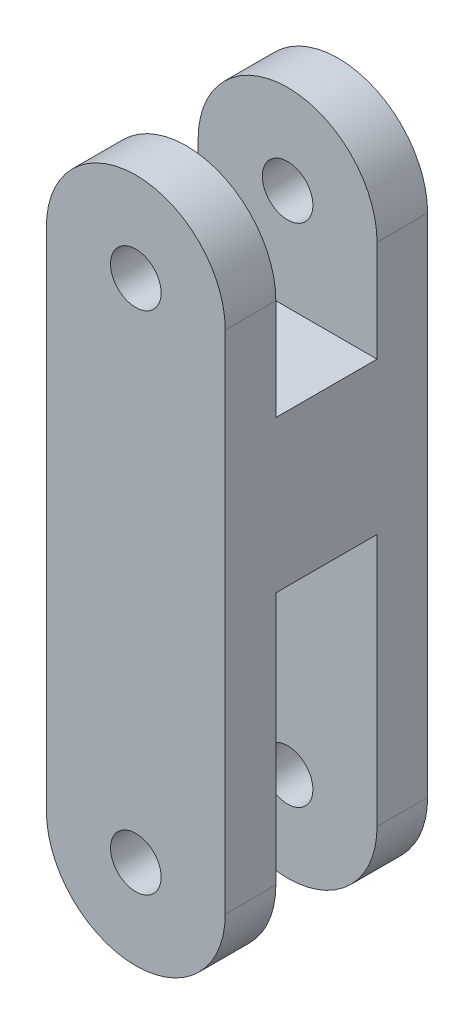
ISO-10303-21;
HEADER;
FILE_DESCRIPTION(('STEP AP214'),'2;1');
FILE_NAME('part.step','',(''),(''),'','','');
FILE_SCHEMA(('AUTOMOTIVE_DESIGN { 1 0 10303 214 1 1 1 1 }'));
ENDSEC;
DATA;
#1=APPLICATION_CONTEXT('core data for automotive mechanical design processes');
#2=APPLICATION_PROTOCOL_DEFINITION('international standard','automotive_design',2000,#1);
#3=PRODUCT_CONTEXT('',#1,'mechanical');
#4=PRODUCT('Part','Part','',(#3));
#5=PRODUCT_RELATED_PRODUCT_CATEGORY('part','',(#4));
#6=PRODUCT_DEFINITION_FORMATION('','',#4);
#7=PRODUCT_DEFINITION_CONTEXT('part definition',#1,'design');
#8=PRODUCT_DEFINITION('design','',#6,#7);
#9=PRODUCT_DEFINITION_SHAPE('','',#8);
#10=(LENGTH_UNIT() NAMED_UNIT(*) SI_UNIT(.MILLI.,.METRE.));
#11=(NAMED_UNIT(*) PLANE_ANGLE_UNIT() SI_UNIT($,.RADIAN.));
#12=(NAMED_UNIT(*) SI_UNIT($,.STERADIAN.) SOLID_ANGLE_UNIT());
#13=UNCERTAINTY_MEASURE_WITH_UNIT(LENGTH_MEASURE(1.E-05),#10,'distance_accuracy_value','');
#14=(GEOMETRIC_REPRESENTATION_CONTEXT(3) GLOBAL_UNCERTAINTY_ASSIGNED_CONTEXT((#13)) GLOBAL_UNIT_ASSIGNED_CONTEXT((#10,
#11,#12)) REPRESENTATION_CONTEXT('',''));
#15=CARTESIAN_POINT('',(0.,0.,0.));
#16=DIRECTION('',(0.,0.,1.));
#17=DIRECTION('',(1.,0.,0.));
#18=AXIS2_PLACEMENT_3D('',#15,#16,#17);
#19=CARTESIAN_POINT('',(35.3553390593274,-270.,-40.));
#20=DIRECTION('',(1.,0.,0.));
#21=DIRECTION('',(0.,1.,0.));
#22=AXIS2_PLACEMENT_3D('',#19,#20,#21);
#23=PLANE('',#22);
#24=DIRECTION('',(0.,0.,1.));
#25=VECTOR('',#24,1.);
#26=CARTESIAN_POINT('',(35.3553390593274,-170.,-112.736184954957));
#27=LINE('',#26,#25);
#28=CARTESIAN_POINT('',(35.3553390593274,-170.,-20.));
#29=VERTEX_POINT('',#28);
#30=CARTESIAN_POINT('',(35.3553390593274,-170.,20.));
#31=VERTEX_POINT('',#30);
#32=EDGE_CURVE('E225',#29,#31,#27,.T.);
#33=ORIENTED_EDGE('',*,*,#32,.F.);
#34=DIRECTION('',(0.,1.,0.));
#35=VECTOR('',#34,1.);
#36=CARTESIAN_POINT('',(35.3553390593274,-230.,-20.));
#37=LINE('',#36,#35);
#38=CARTESIAN_POINT('',(35.3553390593274,-270.,-20.));
#39=VERTEX_POINT('',#38);
#40=EDGE_CURVE('E259',#39,#29,#37,.T.);
#41=ORIENTED_EDGE('',*,*,#40,.F.);
#42=DIRECTION('',(0.,0.,1.));
#43=VECTOR('',#42,1.);
#44=CARTESIAN_POINT('',(35.3553390593274,-270.,-40.));
#45=LINE('',#44,#43);
#46=CARTESIAN_POINT('',(35.3553390593274,-270.,-40.));
#47=VERTEX_POINT('',#46);
#48=EDGE_CURVE('E325',#47,#39,#45,.T.);
#49=ORIENTED_EDGE('',*,*,#48,.F.);
#50=DIRECTION('',(0.,1.,0.));
#51=VECTOR('',#50,1.);
#52=CARTESIAN_POINT('',(35.3553390593274,-270.,-40.));
#53=LINE('',#52,#51);
#54=CARTESIAN_POINT('',(35.3553390593274,-70.,-40.));
#55=VERTEX_POINT('',#54);
#56=EDGE_CURVE('E319',#47,#55,#53,.T.);
#57=ORIENTED_EDGE('',*,*,#56,.T.);
#58=DIRECTION('',(0.,0.,1.));
#59=VECTOR('',#58,1.);
#60=CARTESIAN_POINT('',(35.3553390593274,-70.,-40.));
#61=LINE('',#60,#59);
#62=CARTESIAN_POINT('',(35.3553390593274,-70.,-20.));
#63=VERTEX_POINT('',#62);
#64=EDGE_CURVE('E153',#55,#63,#61,.T.);
#65=ORIENTED_EDGE('',*,*,#64,.T.);
#66=DIRECTION('',(0.,1.,0.));
#67=VECTOR('',#66,1.);
#68=CARTESIAN_POINT('',(35.3553390593274,-110.,-20.));
#69=LINE('',#68,#67);
#70=CARTESIAN_POINT('',(35.3553390593274,-110.,-20.));
#71=VERTEX_POINT('',#70);
#72=EDGE_CURVE('E265',#71,#63,#69,.T.);
#73=ORIENTED_EDGE('',*,*,#72,.F.);
#74=DIRECTION('',(0.,0.,-1.));
#75=VECTOR('',#74,1.);
#76=CARTESIAN_POINT('',(35.3553390593274,-110.,20.));
#77=LINE('',#76,#75);
#78=CARTESIAN_POINT('',(35.3553390593274,-110.,20.));
#79=VERTEX_POINT('',#78);
#80=EDGE_CURVE('E257',#79,#71,#77,.T.);
#81=ORIENTED_EDGE('',*,*,#80,.F.);
#82=DIRECTION('',(0.,1.,0.));
#83=VECTOR('',#82,1.);
#84=CARTESIAN_POINT('',(35.3553390593274,-110.,20.));
#85=LINE('',#84,#83);
#86=CARTESIAN_POINT('',(35.3553390593274,-70.,20.));
#87=VERTEX_POINT('',#86);
#88=EDGE_CURVE('E273',#79,#87,#85,.T.);
#89=ORIENTED_EDGE('',*,*,#88,.T.);
#90=CARTESIAN_POINT('',(35.3553390593274,-70.,40.));
#91=VERTEX_POINT('',#90);
#92=EDGE_CURVE('E324',#87,#91,#61,.T.);
#93=ORIENTED_EDGE('',*,*,#92,.T.);
#94=DIRECTION('',(0.,1.,0.));
#95=VECTOR('',#94,1.);
#96=CARTESIAN_POINT('',(35.3553390593274,-270.,40.));
#97=LINE('',#96,#95);
#98=CARTESIAN_POINT('',(35.3553390593274,-270.,40.));
#99=VERTEX_POINT('',#98);
#100=EDGE_CURVE('E302',#99,#91,#97,.T.);
#101=ORIENTED_EDGE('',*,*,#100,.F.);
#102=CARTESIAN_POINT('',(35.3553390593274,-270.,20.));
#103=VERTEX_POINT('',#102);
#104=EDGE_CURVE('E227',#103,#99,#45,.T.);
#105=ORIENTED_EDGE('',*,*,#104,.F.);
#106=DIRECTION('',(0.,1.,0.));
#107=VECTOR('',#106,1.);
#108=CARTESIAN_POINT('',(35.3553390593274,-230.,20.));
#109=LINE('',#108,#107);
#110=EDGE_CURVE('E222',#103,#31,#109,.T.);
#111=ORIENTED_EDGE('',*,*,#110,.T.);
#112=EDGE_LOOP('',(#33,#41,#49,#57,#65,#73,#81,#89,#93,#101,#105,#111));
#113=FACE_BOUND('',#112,.T.);
#114=ADVANCED_FACE('F40',(#113),#23,.T.);
#115=CARTESIAN_POINT('',(-35.3553390593274,-70.,-40.));
#116=DIRECTION('',(-1.,0.,0.));
#117=DIRECTION('',(0.,-1.,0.));
#118=AXIS2_PLACEMENT_3D('',#115,#116,#117);
#119=PLANE('',#118);
#120=DIRECTION('',(0.,-1.,0.));
#121=VECTOR('',#120,1.);
#122=CARTESIAN_POINT('',(-35.3553390593274,-270.,-20.));
#123=LINE('',#122,#121);
#124=CARTESIAN_POINT('',(-35.3553390593274,-170.,-20.));
#125=VERTEX_POINT('',#124);
#126=CARTESIAN_POINT('',(-35.3553390593274,-270.,-20.));
#127=VERTEX_POINT('',#126);
#128=EDGE_CURVE('E254',#125,#127,#123,.T.);
#129=ORIENTED_EDGE('',*,*,#128,.F.);
#130=DIRECTION('',(0.,0.,1.));
#131=VECTOR('',#130,1.);
#132=CARTESIAN_POINT('',(-35.3553390593274,-170.,-112.736184954957));
#133=LINE('',#132,#131);
#134=CARTESIAN_POINT('',(-35.3553390593274,-170.,20.));
#135=VERTEX_POINT('',#134);
#136=EDGE_CURVE('E243',#125,#135,#133,.T.);
#137=ORIENTED_EDGE('',*,*,#136,.T.);
#138=DIRECTION('',(0.,-1.,0.));
#139=VECTOR('',#138,1.);
#140=CARTESIAN_POINT('',(-35.3553390593274,-270.,20.));
#141=LINE('',#140,#139);
#142=CARTESIAN_POINT('',(-35.3553390593274,-270.,20.));
#143=VERTEX_POINT('',#142);
#144=EDGE_CURVE('E248',#135,#143,#141,.T.);
#145=ORIENTED_EDGE('',*,*,#144,.T.);
#146=DIRECTION('',(0.,0.,1.));
#147=VECTOR('',#146,1.);
#148=CARTESIAN_POINT('',(-35.3553390593274,-270.,-40.));
#149=LINE('',#148,#147);
#150=CARTESIAN_POINT('',(-35.3553390593274,-270.,40.));
#151=VERTEX_POINT('',#150);
#152=EDGE_CURVE('E331',#143,#151,#149,.T.);
#153=ORIENTED_EDGE('',*,*,#152,.T.);
#154=DIRECTION('',(0.,-1.,0.));
#155=VECTOR('',#154,1.);
#156=CARTESIAN_POINT('',(-35.3553390593274,-70.,40.));
#157=LINE('',#156,#155);
#158=CARTESIAN_POINT('',(-35.3553390593274,-70.,40.));
#159=VERTEX_POINT('',#158);
#160=EDGE_CURVE('E296',#159,#151,#157,.T.);
#161=ORIENTED_EDGE('',*,*,#160,.F.);
#162=DIRECTION('',(0.,0.,1.));
#163=VECTOR('',#162,1.);
#164=CARTESIAN_POINT('',(-35.3553390593274,-70.,-40.));
#165=LINE('',#164,#163);
#166=CARTESIAN_POINT('',(-35.3553390593274,-70.,20.));
#167=VERTEX_POINT('',#166);
#168=EDGE_CURVE('E322',#167,#159,#165,.T.);
#169=ORIENTED_EDGE('',*,*,#168,.F.);
#170=DIRECTION('',(0.,-1.,0.));
#171=VECTOR('',#170,1.);
#172=CARTESIAN_POINT('',(-35.3553390593274,-70.,20.));
#173=LINE('',#172,#171);
#174=CARTESIAN_POINT('',(-35.3553390593274,-110.,20.));
#175=VERTEX_POINT('',#174);
#176=EDGE_CURVE('E279',#167,#175,#173,.T.);
#177=ORIENTED_EDGE('',*,*,#176,.T.);
#178=DIRECTION('',(0.,0.,-1.));
#179=VECTOR('',#178,1.);
#180=CARTESIAN_POINT('',(-35.3553390593274,-110.,20.));
#181=LINE('',#180,#179);
#182=CARTESIAN_POINT('',(-35.3553390593274,-110.,-20.));
#183=VERTEX_POINT('',#182);
#184=EDGE_CURVE('E282',#175,#183,#181,.T.);
#185=ORIENTED_EDGE('',*,*,#184,.T.);
#186=DIRECTION('',(0.,-1.,0.));
#187=VECTOR('',#186,1.);
#188=CARTESIAN_POINT('',(-35.3553390593274,-70.,-20.));
#189=LINE('',#188,#187);
#190=CARTESIAN_POINT('',(-35.3553390593274,-70.,-20.));
#191=VERTEX_POINT('',#190);
#192=EDGE_CURVE('E268',#191,#183,#189,.T.);
#193=ORIENTED_EDGE('',*,*,#192,.F.);
#194=CARTESIAN_POINT('',(-35.3553390593274,-70.,-40.));
#195=VERTEX_POINT('',#194);
#196=EDGE_CURVE('E332',#195,#191,#165,.T.);
#197=ORIENTED_EDGE('',*,*,#196,.F.);
#198=DIRECTION('',(0.,-1.,0.));
#199=VECTOR('',#198,1.);
#200=CARTESIAN_POINT('',(-35.3553390593274,-70.,-40.));
#201=LINE('',#200,#199);
#202=CARTESIAN_POINT('',(-35.3553390593274,-270.,-40.));
#203=VERTEX_POINT('',#202);
#204=EDGE_CURVE('E313',#195,#203,#201,.T.);
#205=ORIENTED_EDGE('',*,*,#204,.T.);
#206=EDGE_CURVE('E328',#203,#127,#149,.T.);
#207=ORIENTED_EDGE('',*,*,#206,.T.);
#208=EDGE_LOOP('',(#129,#137,#145,#153,#161,#169,#177,#185,#193,#197,#205,#207));
#209=FACE_BOUND('',#208,.T.);
#210=ADVANCED_FACE('F495',(#209),#119,.T.);
#211=CARTESIAN_POINT('',(0.,-70.,-40.));
#212=DIRECTION('',(0.,0.,1.));
#213=DIRECTION('',(1.,0.,0.));
#214=AXIS2_PLACEMENT_3D('',#211,#212,#213);
#215=CYLINDRICAL_SURFACE('',#214,35.3553390593274);
#216=ORIENTED_EDGE('',*,*,#92,.F.);
#217=CARTESIAN_POINT('',(0.,-70.,20.));
#218=DIRECTION('',(0.,0.,1.));
#219=DIRECTION('',(-1.,0.,0.));
#220=AXIS2_PLACEMENT_3D('',#217,#218,#219);
#221=CIRCLE('',#220,35.3553390593274);
#222=EDGE_CURVE('E276',#87,#167,#221,.T.);
#223=ORIENTED_EDGE('',*,*,#222,.T.);
#224=ORIENTED_EDGE('',*,*,#168,.T.);
#225=CARTESIAN_POINT('',(0.,-70.,40.));
#226=DIRECTION('',(0.,0.,1.));
#227=DIRECTION('',(1.,0.,0.));
#228=AXIS2_PLACEMENT_3D('',#225,#226,#227);
#229=CIRCLE('',#228,35.3553390593274);
#230=EDGE_CURVE('E293',#91,#159,#229,.T.);
#231=ORIENTED_EDGE('',*,*,#230,.F.);
#232=EDGE_LOOP('',(#216,#223,#224,#231));
#233=FACE_BOUND('',#232,.T.);
#234=ADVANCED_FACE('F494',(#233),#215,.T.);
#235=CARTESIAN_POINT('',(0.,-270.,-40.));
#236=DIRECTION('',(0.,0.,1.));
#237=DIRECTION('',(1.,0.,0.));
#238=AXIS2_PLACEMENT_3D('',#235,#236,#237);
#239=CYLINDRICAL_SURFACE('',#238,35.3553390593274);
#240=ORIENTED_EDGE('',*,*,#48,.T.);
#241=CARTESIAN_POINT('',(0.,-270.,-20.));
#242=DIRECTION('',(0.,0.,1.));
#243=DIRECTION('',(1.,0.,0.));
#244=AXIS2_PLACEMENT_3D('',#241,#242,#243);
#245=CIRCLE('',#244,35.3553390593274);
#246=EDGE_CURVE('E256',#127,#39,#245,.T.);
#247=ORIENTED_EDGE('',*,*,#246,.F.);
#248=ORIENTED_EDGE('',*,*,#206,.F.);
#249=CARTESIAN_POINT('',(0.,-270.,-40.));
#250=DIRECTION('',(0.,0.,1.));
#251=DIRECTION('',(1.,0.,0.));
#252=AXIS2_PLACEMENT_3D('',#249,#250,#251);
#253=CIRCLE('',#252,35.3553390593274);
#254=EDGE_CURVE('E316',#203,#47,#253,.T.);
#255=ORIENTED_EDGE('',*,*,#254,.T.);
#256=EDGE_LOOP('',(#240,#247,#248,#255));
#257=FACE_BOUND('',#256,.T.);
#258=ADVANCED_FACE('F503',(#257),#239,.T.);
#259=CARTESIAN_POINT('',(0.,-70.,-40.));
#260=DIRECTION('',(0.,0.,1.));
#261=DIRECTION('',(1.,0.,0.));
#262=AXIS2_PLACEMENT_3D('',#259,#260,#261);
#263=CYLINDRICAL_SURFACE('',#262,9.99999999999999);
#264=CARTESIAN_POINT('',(0.,-70.,40.));
#265=DIRECTION('',(0.,0.,1.));
#266=DIRECTION('',(1.,0.,0.));
#267=AXIS2_PLACEMENT_3D('',#264,#265,#266);
#268=CIRCLE('',#267,9.99999999999999);
#269=CARTESIAN_POINT('',(9.99999999999999,-70.,40.));
#270=VERTEX_POINT('',#269);
#271=EDGE_CURVE('E289',#270,#270,#268,.T.);
#272=ORIENTED_EDGE('',*,*,#271,.T.);
#273=EDGE_LOOP('',(#272));
#274=FACE_BOUND('',#273,.T.);
#275=CARTESIAN_POINT('',(0.,-70.,20.));
#276=DIRECTION('',(0.,0.,-1.));
#277=DIRECTION('',(-1.,0.,0.));
#278=AXIS2_PLACEMENT_3D('',#275,#276,#277);
#279=CIRCLE('',#278,9.99999999999999);
#280=CARTESIAN_POINT('',(-9.99999999999999,-70.,20.));
#281=VERTEX_POINT('',#280);
#282=EDGE_CURVE('E290',#281,#281,#279,.F.);
#283=ORIENTED_EDGE('',*,*,#282,.F.);
#284=EDGE_LOOP('',(#283));
#285=FACE_BOUND('',#284,.T.);
#286=ADVANCED_FACE('F514',(#274,#285),#263,.F.);
#287=CARTESIAN_POINT('',(0.,-270.,-40.));
#288=DIRECTION('',(0.,0.,1.));
#289=DIRECTION('',(1.,0.,0.));
#290=AXIS2_PLACEMENT_3D('',#287,#288,#289);
#291=CYLINDRICAL_SURFACE('',#290,10.);
#292=CARTESIAN_POINT('',(0.,-270.,-40.));
#293=DIRECTION('',(0.,0.,1.));
#294=DIRECTION('',(1.,0.,0.));
#295=AXIS2_PLACEMENT_3D('',#292,#293,#294);
#296=CIRCLE('',#295,10.);
#297=CARTESIAN_POINT('',(10.,-270.,-40.));
#298=VERTEX_POINT('',#297);
#299=EDGE_CURVE('E305',#298,#298,#296,.T.);
#300=ORIENTED_EDGE('',*,*,#299,.F.);
#301=EDGE_LOOP('',(#300));
#302=FACE_BOUND('',#301,.T.);
#303=CARTESIAN_POINT('',(0.,-270.,-20.));
#304=DIRECTION('',(0.,0.,1.));
#305=DIRECTION('',(1.,0.,0.));
#306=AXIS2_PLACEMENT_3D('',#303,#304,#305);
#307=CIRCLE('',#306,10.);
#308=CARTESIAN_POINT('',(10.,-270.,-20.));
#309=VERTEX_POINT('',#308);
#310=EDGE_CURVE('E231',#309,#309,#307,.F.);
#311=ORIENTED_EDGE('',*,*,#310,.F.);
#312=EDGE_LOOP('',(#311));
#313=FACE_BOUND('',#312,.T.);
#314=ADVANCED_FACE('F493',(#302,#313),#291,.F.);
#315=CARTESIAN_POINT('',(0.,-70.,-20.));
#316=DIRECTION('',(0.,0.,1.));
#317=DIRECTION('',(-1.,0.,0.));
#318=AXIS2_PLACEMENT_3D('',#315,#316,#317);
#319=CIRCLE('',#318,35.3553390593274);
#320=EDGE_CURVE('E146',#63,#191,#319,.T.);
#321=ORIENTED_EDGE('',*,*,#320,.F.);
#322=ORIENTED_EDGE('',*,*,#64,.F.);
#323=CARTESIAN_POINT('',(0.,-70.,-40.));
#324=DIRECTION('',(0.,0.,1.));
#325=DIRECTION('',(1.,0.,0.));
#326=AXIS2_PLACEMENT_3D('',#323,#324,#325);
#327=CIRCLE('',#326,35.3553390593274);
#328=EDGE_CURVE('E311',#55,#195,#327,.T.);
#329=ORIENTED_EDGE('',*,*,#328,.T.);
#330=ORIENTED_EDGE('',*,*,#196,.T.);
#331=EDGE_LOOP('',(#321,#322,#329,#330));
#332=FACE_BOUND('',#331,.T.);
#333=ADVANCED_FACE('F489',(#332),#215,.T.);
#334=CARTESIAN_POINT('',(0.,-270.,20.));
#335=DIRECTION('',(0.,0.,1.));
#336=DIRECTION('',(1.,0.,0.));
#337=AXIS2_PLACEMENT_3D('',#334,#335,#336);
#338=CIRCLE('',#337,35.3553390593274);
#339=EDGE_CURVE('E232',#143,#103,#338,.T.);
#340=ORIENTED_EDGE('',*,*,#339,.T.);
#341=ORIENTED_EDGE('',*,*,#104,.T.);
#342=CARTESIAN_POINT('',(0.,-270.,40.));
#343=DIRECTION('',(0.,0.,1.));
#344=DIRECTION('',(1.,0.,0.));
#345=AXIS2_PLACEMENT_3D('',#342,#343,#344);
#346=CIRCLE('',#345,35.3553390593274);
#347=EDGE_CURVE('E299',#151,#99,#346,.T.);
#348=ORIENTED_EDGE('',*,*,#347,.F.);
#349=ORIENTED_EDGE('',*,*,#152,.F.);
#350=EDGE_LOOP('',(#340,#341,#348,#349));
#351=FACE_BOUND('',#350,.T.);
#352=ADVANCED_FACE('F492',(#351),#239,.T.);
#353=CARTESIAN_POINT('',(0.,-70.,-40.));
#354=DIRECTION('',(0.,0.,1.));
#355=DIRECTION('',(1.,0.,0.));
#356=AXIS2_PLACEMENT_3D('',#353,#354,#355);
#357=PLANE('',#356);
#358=ORIENTED_EDGE('',*,*,#299,.T.);
#359=EDGE_LOOP('',(#358));
#360=FACE_BOUND('',#359,.T.);
#361=CARTESIAN_POINT('',(0.,-70.,-40.));
#362=DIRECTION('',(0.,0.,1.));
#363=DIRECTION('',(1.,0.,0.));
#364=AXIS2_PLACEMENT_3D('',#361,#362,#363);
#365=CIRCLE('',#364,9.99999999999999);
#366=CARTESIAN_POINT('',(9.99999999999999,-70.,-40.));
#367=VERTEX_POINT('',#366);
#368=EDGE_CURVE('E308',#367,#367,#365,.T.);
#369=ORIENTED_EDGE('',*,*,#368,.T.);
#370=EDGE_LOOP('',(#369));
#371=FACE_BOUND('',#370,.T.);
#372=ORIENTED_EDGE('',*,*,#328,.F.);
#373=ORIENTED_EDGE('',*,*,#56,.F.);
#374=ORIENTED_EDGE('',*,*,#254,.F.);
#375=ORIENTED_EDGE('',*,*,#204,.F.);
#376=EDGE_LOOP('',(#372,#373,#374,#375));
#377=FACE_BOUND('',#376,.T.);
#378=ADVANCED_FACE('F501',(#360,#371,#377),#357,.F.);
#379=CARTESIAN_POINT('',(0.,-70.,-20.));
#380=DIRECTION('',(0.,0.,-1.));
#381=DIRECTION('',(-1.,0.,0.));
#382=AXIS2_PLACEMENT_3D('',#379,#380,#381);
#383=CIRCLE('',#382,9.99999999999999);
#384=CARTESIAN_POINT('',(-9.99999999999999,-70.,-20.));
#385=VERTEX_POINT('',#384);
#386=EDGE_CURVE('E340',#385,#385,#383,.F.);
#387=ORIENTED_EDGE('',*,*,#386,.T.);
#388=EDGE_LOOP('',(#387));
#389=FACE_BOUND('',#388,.T.);
#390=ORIENTED_EDGE('',*,*,#368,.F.);
#391=EDGE_LOOP('',(#390));
#392=FACE_BOUND('',#391,.T.);
#393=ADVANCED_FACE('F508',(#389,#392),#263,.F.);
#394=CARTESIAN_POINT('',(0.,-270.,20.));
#395=DIRECTION('',(0.,0.,1.));
#396=DIRECTION('',(1.,0.,0.));
#397=AXIS2_PLACEMENT_3D('',#394,#395,#396);
#398=CIRCLE('',#397,10.);
#399=CARTESIAN_POINT('',(10.,-270.,20.));
#400=VERTEX_POINT('',#399);
#401=EDGE_CURVE('E337',#400,#400,#398,.F.);
#402=ORIENTED_EDGE('',*,*,#401,.T.);
#403=EDGE_LOOP('',(#402));
#404=FACE_BOUND('',#403,.T.);
#405=CARTESIAN_POINT('',(0.,-270.,40.));
#406=DIRECTION('',(0.,0.,1.));
#407=DIRECTION('',(1.,0.,0.));
#408=AXIS2_PLACEMENT_3D('',#405,#406,#407);
#409=CIRCLE('',#408,10.);
#410=CARTESIAN_POINT('',(10.,-270.,40.));
#411=VERTEX_POINT('',#410);
#412=EDGE_CURVE('E286',#411,#411,#409,.T.);
#413=ORIENTED_EDGE('',*,*,#412,.T.);
#414=EDGE_LOOP('',(#413));
#415=FACE_BOUND('',#414,.T.);
#416=ADVANCED_FACE('F512',(#404,#415),#291,.F.);
#417=CARTESIAN_POINT('',(0.,-70.,40.));
#418=DIRECTION('',(0.,0.,1.));
#419=DIRECTION('',(1.,0.,0.));
#420=AXIS2_PLACEMENT_3D('',#417,#418,#419);
#421=PLANE('',#420);
#422=ORIENTED_EDGE('',*,*,#271,.F.);
#423=EDGE_LOOP('',(#422));
#424=FACE_BOUND('',#423,.T.);
#425=ORIENTED_EDGE('',*,*,#230,.T.);
#426=ORIENTED_EDGE('',*,*,#160,.T.);
#427=ORIENTED_EDGE('',*,*,#347,.T.);
#428=ORIENTED_EDGE('',*,*,#100,.T.);
#429=EDGE_LOOP('',(#425,#426,#427,#428));
#430=FACE_BOUND('',#429,.T.);
#431=ORIENTED_EDGE('',*,*,#412,.F.);
#432=EDGE_LOOP('',(#431));
#433=FACE_BOUND('',#432,.T.);
#434=ADVANCED_FACE('F517',(#424,#430,#433),#421,.T.);
#435=CARTESIAN_POINT('',(0.,-270.,20.));
#436=DIRECTION('',(0.,0.,1.));
#437=DIRECTION('',(1.,0.,0.));
#438=AXIS2_PLACEMENT_3D('',#435,#436,#437);
#439=PLANE('',#438);
#440=ORIENTED_EDGE('',*,*,#144,.F.);
#441=DIRECTION('',(-1.,0.,0.));
#442=VECTOR('',#441,1.);
#443=CARTESIAN_POINT('',(-35.3553390593274,-170.,20.));
#444=LINE('',#443,#442);
#445=EDGE_CURVE('E239',#31,#135,#444,.T.);
#446=ORIENTED_EDGE('',*,*,#445,.F.);
#447=ORIENTED_EDGE('',*,*,#110,.F.);
#448=ORIENTED_EDGE('',*,*,#339,.F.);
#449=EDGE_LOOP('',(#440,#446,#447,#448));
#450=FACE_BOUND('',#449,.T.);
#451=ORIENTED_EDGE('',*,*,#401,.F.);
#452=EDGE_LOOP('',(#451));
#453=FACE_BOUND('',#452,.T.);
#454=ADVANCED_FACE('F245',(#450,#453),#439,.F.);
#455=CARTESIAN_POINT('',(0.,-270.,-20.));
#456=DIRECTION('',(0.,0.,1.));
#457=DIRECTION('',(1.,0.,0.));
#458=AXIS2_PLACEMENT_3D('',#455,#456,#457);
#459=PLANE('',#458);
#460=ORIENTED_EDGE('',*,*,#128,.T.);
#461=ORIENTED_EDGE('',*,*,#246,.T.);
#462=ORIENTED_EDGE('',*,*,#40,.T.);
#463=DIRECTION('',(1.,0.,0.));
#464=VECTOR('',#463,1.);
#465=CARTESIAN_POINT('',(-35.3553390593274,-170.,-20.));
#466=LINE('',#465,#464);
#467=EDGE_CURVE('E242',#125,#29,#466,.T.);
#468=ORIENTED_EDGE('',*,*,#467,.F.);
#469=EDGE_LOOP('',(#460,#461,#462,#468));
#470=FACE_BOUND('',#469,.T.);
#471=ORIENTED_EDGE('',*,*,#310,.T.);
#472=EDGE_LOOP('',(#471));
#473=FACE_BOUND('',#472,.T.);
#474=ADVANCED_FACE('F530',(#470,#473),#459,.T.);
#475=CARTESIAN_POINT('',(0.,-70.,20.));
#476=DIRECTION('',(0.,0.,-1.));
#477=DIRECTION('',(-1.,0.,0.));
#478=AXIS2_PLACEMENT_3D('',#475,#476,#477);
#479=PLANE('',#478);
#480=DIRECTION('',(1.,0.,0.));
#481=VECTOR('',#480,1.);
#482=CARTESIAN_POINT('',(-35.3553390593274,-110.,20.));
#483=LINE('',#482,#481);
#484=EDGE_CURVE('E270',#175,#79,#483,.T.);
#485=ORIENTED_EDGE('',*,*,#484,.F.);
#486=ORIENTED_EDGE('',*,*,#176,.F.);
#487=ORIENTED_EDGE('',*,*,#222,.F.);
#488=ORIENTED_EDGE('',*,*,#88,.F.);
#489=EDGE_LOOP('',(#485,#486,#487,#488));
#490=FACE_BOUND('',#489,.T.);
#491=ORIENTED_EDGE('',*,*,#282,.T.);
#492=EDGE_LOOP('',(#491));
#493=FACE_BOUND('',#492,.T.);
#494=ADVANCED_FACE('F527',(#490,#493),#479,.T.);
#495=CARTESIAN_POINT('',(0.,-70.,-20.));
#496=DIRECTION('',(0.,0.,-1.));
#497=DIRECTION('',(-1.,0.,0.));
#498=AXIS2_PLACEMENT_3D('',#495,#496,#497);
#499=PLANE('',#498);
#500=DIRECTION('',(1.,0.,0.));
#501=VECTOR('',#500,1.);
#502=CARTESIAN_POINT('',(-35.3553390593274,-110.,-20.));
#503=LINE('',#502,#501);
#504=EDGE_CURVE('E252',#183,#71,#503,.T.);
#505=ORIENTED_EDGE('',*,*,#504,.T.);
#506=ORIENTED_EDGE('',*,*,#72,.T.);
#507=ORIENTED_EDGE('',*,*,#320,.T.);
#508=ORIENTED_EDGE('',*,*,#192,.T.);
#509=EDGE_LOOP('',(#505,#506,#507,#508));
#510=FACE_BOUND('',#509,.T.);
#511=ORIENTED_EDGE('',*,*,#386,.F.);
#512=EDGE_LOOP('',(#511));
#513=FACE_BOUND('',#512,.T.);
#514=ADVANCED_FACE('F525',(#510,#513),#499,.F.);
#515=CARTESIAN_POINT('',(-35.3553390593274,-110.,20.));
#516=DIRECTION('',(0.,1.,0.));
#517=DIRECTION('',(0.,0.,1.));
#518=AXIS2_PLACEMENT_3D('',#515,#516,#517);
#519=PLANE('',#518);
#520=ORIENTED_EDGE('',*,*,#184,.F.);
#521=ORIENTED_EDGE('',*,*,#484,.T.);
#522=ORIENTED_EDGE('',*,*,#80,.T.);
#523=ORIENTED_EDGE('',*,*,#504,.F.);
#524=EDGE_LOOP('',(#520,#521,#522,#523));
#525=FACE_BOUND('',#524,.T.);
#526=ADVANCED_FACE('F522',(#525),#519,.T.);
#527=CARTESIAN_POINT('',(-35.3553390593274,-170.,-112.736184954957));
#528=DIRECTION('',(0.,1.,0.));
#529=DIRECTION('',(0.,0.,1.));
#530=AXIS2_PLACEMENT_3D('',#527,#528,#529);
#531=PLANE('',#530);
#532=ORIENTED_EDGE('',*,*,#467,.T.);
#533=ORIENTED_EDGE('',*,*,#32,.T.);
#534=ORIENTED_EDGE('',*,*,#445,.T.);
#535=ORIENTED_EDGE('',*,*,#136,.F.);
#536=EDGE_LOOP('',(#532,#533,#534,#535));
#537=FACE_BOUND('',#536,.T.);
#538=ADVANCED_FACE('F237',(#537),#531,.F.);
#539=CLOSED_SHELL('',(#114,#210,#234,#258,#286,#314,#333,#352,#378,#393,#416,#434,#454,#474,
#494,#514,#526,#538));
#540=CARTESIAN_POINT('',(30.3553390593274,-270.,-40.));
#541=DIRECTION('',(1.,0.,0.));
#542=DIRECTION('',(0.,1.,0.));
#543=AXIS2_PLACEMENT_3D('',#540,#541,#542);
#544=PLANE('',#543);
#545=DIRECTION('',(0.,0.,1.));
#546=VECTOR('',#545,1.);
#547=CARTESIAN_POINT('',(30.3553390593274,-165.,-40.));
#548=LINE('',#547,#546);
#549=CARTESIAN_POINT('',(30.3553390593274,-165.,-25.));
#550=VERTEX_POINT('',#549);
#551=CARTESIAN_POINT('',(30.3553390593274,-165.,25.));
#552=VERTEX_POINT('',#551);
#553=EDGE_CURVE('E51',#550,#552,#548,.T.);
#554=ORIENTED_EDGE('',*,*,#553,.T.);
#555=DIRECTION('',(0.,1.,0.));
#556=VECTOR('',#555,1.);
#557=CARTESIAN_POINT('',(30.3553390593274,-270.,25.));
#558=LINE('',#557,#556);
#559=CARTESIAN_POINT('',(30.3553390593274,-270.,25.));
#560=VERTEX_POINT('',#559);
#561=EDGE_CURVE('E441',#560,#552,#558,.T.);
#562=ORIENTED_EDGE('',*,*,#561,.F.);
#563=DIRECTION('',(0.,0.,1.));
#564=VECTOR('',#563,1.);
#565=CARTESIAN_POINT('',(30.3553390593274,-270.,-40.));
#566=LINE('',#565,#564);
#567=CARTESIAN_POINT('',(30.3553390593274,-270.,35.));
#568=VERTEX_POINT('',#567);
#569=EDGE_CURVE('E399',#560,#568,#566,.T.);
#570=ORIENTED_EDGE('',*,*,#569,.T.);
#571=DIRECTION('',(0.,1.,0.));
#572=VECTOR('',#571,1.);
#573=CARTESIAN_POINT('',(30.3553390593274,-70.,35.));
#574=LINE('',#573,#572);
#575=CARTESIAN_POINT('',(30.3553390593274,-70.,35.));
#576=VERTEX_POINT('',#575);
#577=EDGE_CURVE('E374',#568,#576,#574,.T.);
#578=ORIENTED_EDGE('',*,*,#577,.T.);
#579=DIRECTION('',(0.,0.,1.));
#580=VECTOR('',#579,1.);
#581=CARTESIAN_POINT('',(30.3553390593274,-70.,-40.));
#582=LINE('',#581,#580);
#583=CARTESIAN_POINT('',(30.3553390593274,-70.,25.));
#584=VERTEX_POINT('',#583);
#585=EDGE_CURVE('E132',#584,#576,#582,.T.);
#586=ORIENTED_EDGE('',*,*,#585,.F.);
#587=DIRECTION('',(0.,1.,0.));
#588=VECTOR('',#587,1.);
#589=CARTESIAN_POINT('',(30.3553390593274,-270.,25.));
#590=LINE('',#589,#588);
#591=CARTESIAN_POINT('',(30.3553390593274,-115.,25.));
#592=VERTEX_POINT('',#591);
#593=EDGE_CURVE('E444',#592,#584,#590,.T.);
#594=ORIENTED_EDGE('',*,*,#593,.F.);
#595=DIRECTION('',(0.,0.,-1.));
#596=VECTOR('',#595,1.);
#597=CARTESIAN_POINT('',(30.3553390593274,-115.,20.));
#598=LINE('',#597,#596);
#599=CARTESIAN_POINT('',(30.3553390593274,-115.,-25.));
#600=VERTEX_POINT('',#599);
#601=EDGE_CURVE('E350',#592,#600,#598,.T.);
#602=ORIENTED_EDGE('',*,*,#601,.T.);
#603=DIRECTION('',(0.,1.,0.));
#604=VECTOR('',#603,1.);
#605=CARTESIAN_POINT('',(30.3553390593274,-270.,-25.));
#606=LINE('',#605,#604);
#607=CARTESIAN_POINT('',(30.3553390593274,-70.,-25.));
#608=VERTEX_POINT('',#607);
#609=EDGE_CURVE('E359',#600,#608,#606,.T.);
#610=ORIENTED_EDGE('',*,*,#609,.T.);
#611=DIRECTION('',(0.,0.,1.));
#612=VECTOR('',#611,1.);
#613=CARTESIAN_POINT('',(30.3553390593274,-70.,-40.));
#614=LINE('',#613,#612);
#615=CARTESIAN_POINT('',(30.3553390593274,-70.,-35.));
#616=VERTEX_POINT('',#615);
#617=EDGE_CURVE('E446',#616,#608,#614,.T.);
#618=ORIENTED_EDGE('',*,*,#617,.F.);
#619=DIRECTION('',(0.,1.,0.));
#620=VECTOR('',#619,1.);
#621=CARTESIAN_POINT('',(30.3553390593274,-70.,-35.));
#622=LINE('',#621,#620);
#623=CARTESIAN_POINT('',(30.3553390593274,-270.,-35.));
#624=VERTEX_POINT('',#623);
#625=EDGE_CURVE('E44',#624,#616,#622,.T.);
#626=ORIENTED_EDGE('',*,*,#625,.F.);
#627=DIRECTION('',(0.,0.,1.));
#628=VECTOR('',#627,1.);
#629=CARTESIAN_POINT('',(30.3553390593274,-270.,-40.));
#630=LINE('',#629,#628);
#631=CARTESIAN_POINT('',(30.3553390593274,-270.,-25.));
#632=VERTEX_POINT('',#631);
#633=EDGE_CURVE('E138',#624,#632,#630,.T.);
#634=ORIENTED_EDGE('',*,*,#633,.T.);
#635=DIRECTION('',(0.,1.,0.));
#636=VECTOR('',#635,1.);
#637=CARTESIAN_POINT('',(30.3553390593274,-270.,-25.));
#638=LINE('',#637,#636);
#639=EDGE_CURVE('E368',#632,#550,#638,.T.);
#640=ORIENTED_EDGE('',*,*,#639,.T.);
#641=EDGE_LOOP('',(#554,#562,#570,#578,#586,#594,#602,#610,#618,#626,#634,#640));
#642=FACE_BOUND('',#641,.T.);
#643=ADVANCED_FACE('F455',(#642),#544,.F.);
#644=CARTESIAN_POINT('',(-30.3553390593274,-70.,-40.));
#645=DIRECTION('',(-1.,0.,0.));
#646=DIRECTION('',(0.,-1.,0.));
#647=AXIS2_PLACEMENT_3D('',#644,#645,#646);
#648=PLANE('',#647);
#649=DIRECTION('',(0.,-1.,0.));
#650=VECTOR('',#649,1.);
#651=CARTESIAN_POINT('',(-30.3553390593274,-270.,-25.));
#652=LINE('',#651,#650);
#653=CARTESIAN_POINT('',(-30.3553390593274,-165.,-25.));
#654=VERTEX_POINT('',#653);
#655=CARTESIAN_POINT('',(-30.3553390593274,-270.,-25.));
#656=VERTEX_POINT('',#655);
#657=EDGE_CURVE('E372',#654,#656,#652,.T.);
#658=ORIENTED_EDGE('',*,*,#657,.T.);
#659=DIRECTION('',(0.,0.,1.));
#660=VECTOR('',#659,1.);
#661=CARTESIAN_POINT('',(-30.3553390593274,-270.,-40.));
#662=LINE('',#661,#660);
#663=CARTESIAN_POINT('',(-30.3553390593274,-270.,-35.));
#664=VERTEX_POINT('',#663);
#665=EDGE_CURVE('E421',#664,#656,#662,.T.);
#666=ORIENTED_EDGE('',*,*,#665,.F.);
#667=DIRECTION('',(0.,-1.,0.));
#668=VECTOR('',#667,1.);
#669=CARTESIAN_POINT('',(-30.3553390593274,-70.,-35.));
#670=LINE('',#669,#668);
#671=CARTESIAN_POINT('',(-30.3553390593274,-70.,-35.));
#672=VERTEX_POINT('',#671);
#673=EDGE_CURVE('E424',#672,#664,#670,.T.);
#674=ORIENTED_EDGE('',*,*,#673,.F.);
#675=DIRECTION('',(0.,0.,1.));
#676=VECTOR('',#675,1.);
#677=CARTESIAN_POINT('',(-30.3553390593274,-70.,-40.));
#678=LINE('',#677,#676);
#679=CARTESIAN_POINT('',(-30.3553390593274,-70.,-25.));
#680=VERTEX_POINT('',#679);
#681=EDGE_CURVE('E404',#672,#680,#678,.T.);
#682=ORIENTED_EDGE('',*,*,#681,.T.);
#683=DIRECTION('',(0.,-1.,0.));
#684=VECTOR('',#683,1.);
#685=CARTESIAN_POINT('',(-30.3553390593274,-70.,-25.));
#686=LINE('',#685,#684);
#687=CARTESIAN_POINT('',(-30.3553390593274,-115.,-25.));
#688=VERTEX_POINT('',#687);
#689=EDGE_CURVE('E355',#680,#688,#686,.T.);
#690=ORIENTED_EDGE('',*,*,#689,.T.);
#691=DIRECTION('',(0.,0.,-1.));
#692=VECTOR('',#691,1.);
#693=CARTESIAN_POINT('',(-30.3553390593274,-115.,-40.));
#694=LINE('',#693,#692);
#695=CARTESIAN_POINT('',(-30.3553390593274,-115.,25.));
#696=VERTEX_POINT('',#695);
#697=EDGE_CURVE('E427',#696,#688,#694,.T.);
#698=ORIENTED_EDGE('',*,*,#697,.F.);
#699=DIRECTION('',(0.,-1.,0.));
#700=VECTOR('',#699,1.);
#701=CARTESIAN_POINT('',(-30.3553390593274,-70.,25.));
#702=LINE('',#701,#700);
#703=CARTESIAN_POINT('',(-30.3553390593274,-70.,25.));
#704=VERTEX_POINT('',#703);
#705=EDGE_CURVE('E430',#704,#696,#702,.T.);
#706=ORIENTED_EDGE('',*,*,#705,.F.);
#707=DIRECTION('',(0.,0.,1.));
#708=VECTOR('',#707,1.);
#709=CARTESIAN_POINT('',(-30.3553390593274,-70.,-40.));
#710=LINE('',#709,#708);
#711=CARTESIAN_POINT('',(-30.3553390593274,-70.,35.));
#712=VERTEX_POINT('',#711);
#713=EDGE_CURVE('E416',#704,#712,#710,.T.);
#714=ORIENTED_EDGE('',*,*,#713,.T.);
#715=DIRECTION('',(0.,-1.,0.));
#716=VECTOR('',#715,1.);
#717=CARTESIAN_POINT('',(-30.3553390593274,-70.,35.));
#718=LINE('',#717,#716);
#719=CARTESIAN_POINT('',(-30.3553390593274,-270.,35.));
#720=VERTEX_POINT('',#719);
#721=EDGE_CURVE('E379',#712,#720,#718,.T.);
#722=ORIENTED_EDGE('',*,*,#721,.T.);
#723=DIRECTION('',(0.,0.,1.));
#724=VECTOR('',#723,1.);
#725=CARTESIAN_POINT('',(-30.3553390593274,-270.,-40.));
#726=LINE('',#725,#724);
#727=CARTESIAN_POINT('',(-30.3553390593274,-270.,25.));
#728=VERTEX_POINT('',#727);
#729=EDGE_CURVE('E433',#728,#720,#726,.T.);
#730=ORIENTED_EDGE('',*,*,#729,.F.);
#731=DIRECTION('',(0.,-1.,0.));
#732=VECTOR('',#731,1.);
#733=CARTESIAN_POINT('',(-30.3553390593274,-270.,25.));
#734=LINE('',#733,#732);
#735=CARTESIAN_POINT('',(-30.3553390593274,-165.,25.));
#736=VERTEX_POINT('',#735);
#737=EDGE_CURVE('E435',#736,#728,#734,.T.);
#738=ORIENTED_EDGE('',*,*,#737,.F.);
#739=DIRECTION('',(0.,0.,1.));
#740=VECTOR('',#739,1.);
#741=CARTESIAN_POINT('',(-30.3553390593274,-165.,-112.736184954957));
#742=LINE('',#741,#740);
#743=EDGE_CURVE('E438',#654,#736,#742,.T.);
#744=ORIENTED_EDGE('',*,*,#743,.F.);
#745=EDGE_LOOP('',(#658,#666,#674,#682,#690,#698,#706,#714,#722,#730,#738,#744));
#746=FACE_BOUND('',#745,.T.);
#747=ADVANCED_FACE('F460',(#746),#648,.F.);
#748=CARTESIAN_POINT('',(0.,-70.,-40.));
#749=DIRECTION('',(0.,0.,1.));
#750=DIRECTION('',(1.,0.,0.));
#751=AXIS2_PLACEMENT_3D('',#748,#749,#750);
#752=CYLINDRICAL_SURFACE('',#751,30.3553390593274);
#753=ORIENTED_EDGE('',*,*,#585,.T.);
#754=CARTESIAN_POINT('',(0.,-70.,35.));
#755=DIRECTION('',(0.,0.,1.));
#756=DIRECTION('',(1.,0.,0.));
#757=AXIS2_PLACEMENT_3D('',#754,#755,#756);
#758=CIRCLE('',#757,30.3553390593274);
#759=EDGE_CURVE('E382',#576,#712,#758,.T.);
#760=ORIENTED_EDGE('',*,*,#759,.T.);
#761=ORIENTED_EDGE('',*,*,#713,.F.);
#762=CARTESIAN_POINT('',(0.,-70.,25.));
#763=DIRECTION('',(0.,0.,-1.));
#764=DIRECTION('',(-1.,0.,0.));
#765=AXIS2_PLACEMENT_3D('',#762,#763,#764);
#766=CIRCLE('',#765,30.3553390593274);
#767=EDGE_CURVE('E418',#584,#704,#766,.F.);
#768=ORIENTED_EDGE('',*,*,#767,.F.);
#769=EDGE_LOOP('',(#753,#760,#761,#768));
#770=FACE_BOUND('',#769,.T.);
#771=ADVANCED_FACE('F466',(#770),#752,.F.);
#772=CARTESIAN_POINT('',(0.,-270.,-40.));
#773=DIRECTION('',(0.,0.,1.));
#774=DIRECTION('',(1.,0.,0.));
#775=AXIS2_PLACEMENT_3D('',#772,#773,#774);
#776=CYLINDRICAL_SURFACE('',#775,30.3553390593274);
#777=ORIENTED_EDGE('',*,*,#633,.F.);
#778=CARTESIAN_POINT('',(0.,-270.,-35.));
#779=DIRECTION('',(0.,0.,1.));
#780=DIRECTION('',(1.,0.,0.));
#781=AXIS2_PLACEMENT_3D('',#778,#779,#780);
#782=CIRCLE('',#781,30.3553390593274);
#783=EDGE_CURVE('E413',#664,#624,#782,.T.);
#784=ORIENTED_EDGE('',*,*,#783,.F.);
#785=ORIENTED_EDGE('',*,*,#665,.T.);
#786=CARTESIAN_POINT('',(0.,-270.,-25.));
#787=DIRECTION('',(0.,0.,1.));
#788=DIRECTION('',(1.,0.,0.));
#789=AXIS2_PLACEMENT_3D('',#786,#787,#788);
#790=CIRCLE('',#789,30.3553390593274);
#791=EDGE_CURVE('E370',#656,#632,#790,.T.);
#792=ORIENTED_EDGE('',*,*,#791,.T.);
#793=EDGE_LOOP('',(#777,#784,#785,#792));
#794=FACE_BOUND('',#793,.T.);
#795=ADVANCED_FACE('F463',(#794),#776,.F.);
#796=CARTESIAN_POINT('',(0.,-70.,-40.));
#797=DIRECTION('',(0.,0.,1.));
#798=DIRECTION('',(1.,0.,0.));
#799=AXIS2_PLACEMENT_3D('',#796,#797,#798);
#800=CYLINDRICAL_SURFACE('',#799,15.);
#801=CARTESIAN_POINT('',(0.,-70.,35.));
#802=DIRECTION('',(0.,0.,1.));
#803=DIRECTION('',(1.,0.,0.));
#804=AXIS2_PLACEMENT_3D('',#801,#802,#803);
#805=CIRCLE('',#804,15.);
#806=CARTESIAN_POINT('',(15.,-70.,35.));
#807=VERTEX_POINT('',#806);
#808=EDGE_CURVE('E410',#807,#807,#805,.T.);
#809=ORIENTED_EDGE('',*,*,#808,.F.);
#810=EDGE_LOOP('',(#809));
#811=FACE_BOUND('',#810,.T.);
#812=CARTESIAN_POINT('',(0.,-70.,25.));
#813=DIRECTION('',(0.,0.,-1.));
#814=DIRECTION('',(-1.,0.,0.));
#815=AXIS2_PLACEMENT_3D('',#812,#813,#814);
#816=CIRCLE('',#815,15.);
#817=CARTESIAN_POINT('',(-15.,-70.,25.));
#818=VERTEX_POINT('',#817);
#819=EDGE_CURVE('E362',#818,#818,#816,.F.);
#820=ORIENTED_EDGE('',*,*,#819,.T.);
#821=EDGE_LOOP('',(#820));
#822=FACE_BOUND('',#821,.T.);
#823=ADVANCED_FACE('F465',(#811,#822),#800,.T.);
#824=CARTESIAN_POINT('',(0.,-270.,-40.));
#825=DIRECTION('',(0.,0.,1.));
#826=DIRECTION('',(1.,0.,0.));
#827=AXIS2_PLACEMENT_3D('',#824,#825,#826);
#828=CYLINDRICAL_SURFACE('',#827,15.);
#829=CARTESIAN_POINT('',(0.,-270.,-35.));
#830=DIRECTION('',(0.,0.,1.));
#831=DIRECTION('',(1.,0.,0.));
#832=AXIS2_PLACEMENT_3D('',#829,#830,#831);
#833=CIRCLE('',#832,15.);
#834=CARTESIAN_POINT('',(15.,-270.,-35.));
#835=VERTEX_POINT('',#834);
#836=EDGE_CURVE('E396',#835,#835,#833,.T.);
#837=ORIENTED_EDGE('',*,*,#836,.T.);
#838=EDGE_LOOP('',(#837));
#839=FACE_BOUND('',#838,.T.);
#840=CARTESIAN_POINT('',(0.,-270.,-25.));
#841=DIRECTION('',(0.,0.,1.));
#842=DIRECTION('',(1.,0.,0.));
#843=AXIS2_PLACEMENT_3D('',#840,#841,#842);
#844=CIRCLE('',#843,15.);
#845=CARTESIAN_POINT('',(15.,-270.,-25.));
#846=VERTEX_POINT('',#845);
#847=EDGE_CURVE('E365',#846,#846,#844,.F.);
#848=ORIENTED_EDGE('',*,*,#847,.T.);
#849=EDGE_LOOP('',(#848));
#850=FACE_BOUND('',#849,.T.);
#851=ADVANCED_FACE('F474',(#839,#850),#828,.T.);
#852=CARTESIAN_POINT('',(0.,-70.,-25.));
#853=DIRECTION('',(0.,0.,-1.));
#854=DIRECTION('',(-1.,0.,0.));
#855=AXIS2_PLACEMENT_3D('',#852,#853,#854);
#856=CIRCLE('',#855,30.3553390593274);
#857=EDGE_CURVE('E357',#608,#680,#856,.F.);
#858=ORIENTED_EDGE('',*,*,#857,.T.);
#859=ORIENTED_EDGE('',*,*,#681,.F.);
#860=CARTESIAN_POINT('',(0.,-70.,-35.));
#861=DIRECTION('',(0.,0.,1.));
#862=DIRECTION('',(1.,0.,0.));
#863=AXIS2_PLACEMENT_3D('',#860,#861,#862);
#864=CIRCLE('',#863,30.3553390593274);
#865=EDGE_CURVE('E407',#616,#672,#864,.T.);
#866=ORIENTED_EDGE('',*,*,#865,.F.);
#867=ORIENTED_EDGE('',*,*,#617,.T.);
#868=EDGE_LOOP('',(#858,#859,#866,#867));
#869=FACE_BOUND('',#868,.T.);
#870=ADVANCED_FACE('F457',(#869),#752,.F.);
#871=CARTESIAN_POINT('',(0.,-270.,25.));
#872=DIRECTION('',(0.,0.,1.));
#873=DIRECTION('',(1.,0.,0.));
#874=AXIS2_PLACEMENT_3D('',#871,#872,#873);
#875=CIRCLE('',#874,30.3553390593274);
#876=EDGE_CURVE('E401',#728,#560,#875,.T.);
#877=ORIENTED_EDGE('',*,*,#876,.F.);
#878=ORIENTED_EDGE('',*,*,#729,.T.);
#879=CARTESIAN_POINT('',(0.,-270.,35.));
#880=DIRECTION('',(0.,0.,1.));
#881=DIRECTION('',(1.,0.,0.));
#882=AXIS2_PLACEMENT_3D('',#879,#880,#881);
#883=CIRCLE('',#882,30.3553390593274);
#884=EDGE_CURVE('E376',#720,#568,#883,.T.);
#885=ORIENTED_EDGE('',*,*,#884,.T.);
#886=ORIENTED_EDGE('',*,*,#569,.F.);
#887=EDGE_LOOP('',(#877,#878,#885,#886));
#888=FACE_BOUND('',#887,.T.);
#889=ADVANCED_FACE('F468',(#888),#776,.F.);
#890=CARTESIAN_POINT('',(0.,-70.,-35.));
#891=DIRECTION('',(0.,0.,1.));
#892=DIRECTION('',(1.,0.,0.));
#893=AXIS2_PLACEMENT_3D('',#890,#891,#892);
#894=PLANE('',#893);
#895=ORIENTED_EDGE('',*,*,#836,.F.);
#896=EDGE_LOOP('',(#895));
#897=FACE_BOUND('',#896,.T.);
#898=CARTESIAN_POINT('',(0.,-70.,-35.));
#899=DIRECTION('',(0.,0.,1.));
#900=DIRECTION('',(1.,0.,0.));
#901=AXIS2_PLACEMENT_3D('',#898,#899,#900);
#902=CIRCLE('',#901,15.);
#903=CARTESIAN_POINT('',(15.,-70.,-35.));
#904=VERTEX_POINT('',#903);
#905=EDGE_CURVE('E393',#904,#904,#902,.T.);
#906=ORIENTED_EDGE('',*,*,#905,.F.);
#907=EDGE_LOOP('',(#906));
#908=FACE_BOUND('',#907,.T.);
#909=ORIENTED_EDGE('',*,*,#865,.T.);
#910=ORIENTED_EDGE('',*,*,#673,.T.);
#911=ORIENTED_EDGE('',*,*,#783,.T.);
#912=ORIENTED_EDGE('',*,*,#625,.T.);
#913=EDGE_LOOP('',(#909,#910,#911,#912));
#914=FACE_BOUND('',#913,.T.);
#915=ADVANCED_FACE('F453',(#897,#908,#914),#894,.T.);
#916=CARTESIAN_POINT('',(0.,-70.,-25.));
#917=DIRECTION('',(0.,0.,-1.));
#918=DIRECTION('',(-1.,0.,0.));
#919=AXIS2_PLACEMENT_3D('',#916,#917,#918);
#920=CIRCLE('',#919,15.);
#921=CARTESIAN_POINT('',(-15.,-70.,-25.));
#922=VERTEX_POINT('',#921);
#923=EDGE_CURVE('E390',#922,#922,#920,.F.);
#924=ORIENTED_EDGE('',*,*,#923,.F.);
#925=EDGE_LOOP('',(#924));
#926=FACE_BOUND('',#925,.T.);
#927=ORIENTED_EDGE('',*,*,#905,.T.);
#928=EDGE_LOOP('',(#927));
#929=FACE_BOUND('',#928,.T.);
#930=ADVANCED_FACE('F477',(#926,#929),#800,.T.);
#931=CARTESIAN_POINT('',(0.,-270.,25.));
#932=DIRECTION('',(0.,0.,1.));
#933=DIRECTION('',(1.,0.,0.));
#934=AXIS2_PLACEMENT_3D('',#931,#932,#933);
#935=CIRCLE('',#934,15.);
#936=CARTESIAN_POINT('',(15.,-270.,25.));
#937=VERTEX_POINT('',#936);
#938=EDGE_CURVE('E387',#937,#937,#935,.F.);
#939=ORIENTED_EDGE('',*,*,#938,.F.);
#940=EDGE_LOOP('',(#939));
#941=FACE_BOUND('',#940,.T.);
#942=CARTESIAN_POINT('',(0.,-270.,35.));
#943=DIRECTION('',(0.,0.,1.));
#944=DIRECTION('',(1.,0.,0.));
#945=AXIS2_PLACEMENT_3D('',#942,#943,#944);
#946=CIRCLE('',#945,15.);
#947=CARTESIAN_POINT('',(15.,-270.,35.));
#948=VERTEX_POINT('',#947);
#949=EDGE_CURVE('E384',#948,#948,#946,.T.);
#950=ORIENTED_EDGE('',*,*,#949,.F.);
#951=EDGE_LOOP('',(#950));
#952=FACE_BOUND('',#951,.T.);
#953=ADVANCED_FACE('F666',(#941,#952),#828,.T.);
#954=CARTESIAN_POINT('',(0.,-70.,35.));
#955=DIRECTION('',(0.,0.,1.));
#956=DIRECTION('',(1.,0.,0.));
#957=AXIS2_PLACEMENT_3D('',#954,#955,#956);
#958=PLANE('',#957);
#959=ORIENTED_EDGE('',*,*,#808,.T.);
#960=EDGE_LOOP('',(#959));
#961=FACE_BOUND('',#960,.T.);
#962=ORIENTED_EDGE('',*,*,#759,.F.);
#963=ORIENTED_EDGE('',*,*,#577,.F.);
#964=ORIENTED_EDGE('',*,*,#884,.F.);
#965=ORIENTED_EDGE('',*,*,#721,.F.);
#966=EDGE_LOOP('',(#962,#963,#964,#965));
#967=FACE_BOUND('',#966,.T.);
#968=ORIENTED_EDGE('',*,*,#949,.T.);
#969=EDGE_LOOP('',(#968));
#970=FACE_BOUND('',#969,.T.);
#971=ADVANCED_FACE('F699',(#961,#967,#970),#958,.F.);
#972=CARTESIAN_POINT('',(0.,-270.,25.));
#973=DIRECTION('',(0.,0.,1.));
#974=DIRECTION('',(1.,0.,0.));
#975=AXIS2_PLACEMENT_3D('',#972,#973,#974);
#976=PLANE('',#975);
#977=ORIENTED_EDGE('',*,*,#737,.T.);
#978=ORIENTED_EDGE('',*,*,#876,.T.);
#979=ORIENTED_EDGE('',*,*,#561,.T.);
#980=DIRECTION('',(-1.,0.,0.));
#981=VECTOR('',#980,1.);
#982=CARTESIAN_POINT('',(0.,-165.,25.));
#983=LINE('',#982,#981);
#984=EDGE_CURVE('E11',#552,#736,#983,.T.);
#985=ORIENTED_EDGE('',*,*,#984,.T.);
#986=EDGE_LOOP('',(#977,#978,#979,#985));
#987=FACE_BOUND('',#986,.T.);
#988=ORIENTED_EDGE('',*,*,#938,.T.);
#989=EDGE_LOOP('',(#988));
#990=FACE_BOUND('',#989,.T.);
#991=ADVANCED_FACE('F707',(#987,#990),#976,.T.);
#992=CARTESIAN_POINT('',(0.,-270.,-25.));
#993=DIRECTION('',(0.,0.,1.));
#994=DIRECTION('',(1.,0.,0.));
#995=AXIS2_PLACEMENT_3D('',#992,#993,#994);
#996=PLANE('',#995);
#997=ORIENTED_EDGE('',*,*,#657,.F.);
#998=DIRECTION('',(1.,0.,0.));
#999=VECTOR('',#998,1.);
#1000=CARTESIAN_POINT('',(-35.3553390593274,-165.,-25.));
#1001=LINE('',#1000,#999);
#1002=EDGE_CURVE('E347',#654,#550,#1001,.T.);
#1003=ORIENTED_EDGE('',*,*,#1002,.T.);
#1004=ORIENTED_EDGE('',*,*,#639,.F.);
#1005=ORIENTED_EDGE('',*,*,#791,.F.);
#1006=EDGE_LOOP('',(#997,#1003,#1004,#1005));
#1007=FACE_BOUND('',#1006,.T.);
#1008=ORIENTED_EDGE('',*,*,#847,.F.);
#1009=EDGE_LOOP('',(#1008));
#1010=FACE_BOUND('',#1009,.T.);
#1011=ADVANCED_FACE('F716',(#1007,#1010),#996,.F.);
#1012=CARTESIAN_POINT('',(0.,-70.,25.));
#1013=DIRECTION('',(0.,0.,-1.));
#1014=DIRECTION('',(-1.,0.,0.));
#1015=AXIS2_PLACEMENT_3D('',#1012,#1013,#1014);
#1016=PLANE('',#1015);
#1017=DIRECTION('',(1.,0.,0.));
#1018=VECTOR('',#1017,1.);
#1019=CARTESIAN_POINT('',(0.,-115.,25.));
#1020=LINE('',#1019,#1018);
#1021=EDGE_CURVE('E352',#696,#592,#1020,.T.);
#1022=ORIENTED_EDGE('',*,*,#1021,.T.);
#1023=ORIENTED_EDGE('',*,*,#593,.T.);
#1024=ORIENTED_EDGE('',*,*,#767,.T.);
#1025=ORIENTED_EDGE('',*,*,#705,.T.);
#1026=EDGE_LOOP('',(#1022,#1023,#1024,#1025));
#1027=FACE_BOUND('',#1026,.T.);
#1028=ORIENTED_EDGE('',*,*,#819,.F.);
#1029=EDGE_LOOP('',(#1028));
#1030=FACE_BOUND('',#1029,.T.);
#1031=ADVANCED_FACE('F728',(#1027,#1030),#1016,.F.);
#1032=CARTESIAN_POINT('',(0.,-70.,-25.));
#1033=DIRECTION('',(0.,0.,-1.));
#1034=DIRECTION('',(-1.,0.,0.));
#1035=AXIS2_PLACEMENT_3D('',#1032,#1033,#1034);
#1036=PLANE('',#1035);
#1037=DIRECTION('',(1.,0.,0.));
#1038=VECTOR('',#1037,1.);
#1039=CARTESIAN_POINT('',(0.,-115.,-25.));
#1040=LINE('',#1039,#1038);
#1041=EDGE_CURVE('E60',#688,#600,#1040,.T.);
#1042=ORIENTED_EDGE('',*,*,#1041,.F.);
#1043=ORIENTED_EDGE('',*,*,#689,.F.);
#1044=ORIENTED_EDGE('',*,*,#857,.F.);
#1045=ORIENTED_EDGE('',*,*,#609,.F.);
#1046=EDGE_LOOP('',(#1042,#1043,#1044,#1045));
#1047=FACE_BOUND('',#1046,.T.);
#1048=ORIENTED_EDGE('',*,*,#923,.T.);
#1049=EDGE_LOOP('',(#1048));
#1050=FACE_BOUND('',#1049,.T.);
#1051=ADVANCED_FACE('F740',(#1047,#1050),#1036,.T.);
#1052=CARTESIAN_POINT('',(-35.3553390593274,-115.,20.));
#1053=DIRECTION('',(0.,1.,0.));
#1054=DIRECTION('',(0.,0.,1.));
#1055=AXIS2_PLACEMENT_3D('',#1052,#1053,#1054);
#1056=PLANE('',#1055);
#1057=ORIENTED_EDGE('',*,*,#697,.T.);
#1058=ORIENTED_EDGE('',*,*,#1041,.T.);
#1059=ORIENTED_EDGE('',*,*,#601,.F.);
#1060=ORIENTED_EDGE('',*,*,#1021,.F.);
#1061=EDGE_LOOP('',(#1057,#1058,#1059,#1060));
#1062=FACE_BOUND('',#1061,.T.);
#1063=ADVANCED_FACE('F749',(#1062),#1056,.F.);
#1064=CARTESIAN_POINT('',(-35.3553390593274,-165.,-112.736184954957));
#1065=DIRECTION('',(0.,1.,0.));
#1066=DIRECTION('',(0.,0.,1.));
#1067=AXIS2_PLACEMENT_3D('',#1064,#1065,#1066);
#1068=PLANE('',#1067);
#1069=ORIENTED_EDGE('',*,*,#1002,.F.);
#1070=ORIENTED_EDGE('',*,*,#743,.T.);
#1071=ORIENTED_EDGE('',*,*,#984,.F.);
#1072=ORIENTED_EDGE('',*,*,#553,.F.);
#1073=EDGE_LOOP('',(#1069,#1070,#1071,#1072));
#1074=FACE_BOUND('',#1073,.T.);
#1075=ADVANCED_FACE('F42',(#1074),#1068,.T.);
#1076=CLOSED_SHELL('',(#643,#747,#771,#795,#823,#851,#870,#889,#915,#930,#953,#971,#991,#1011,
#1031,#1051,#1063,#1075));
#1077=ORIENTED_CLOSED_SHELL('',*,#1076,.T.);
#1078=BREP_WITH_VOIDS('B2',#539,(#1077));
#1079=ADVANCED_BREP_SHAPE_REPRESENTATION('',(#18,#1078),#14);
#1080=SHAPE_DEFINITION_REPRESENTATION(#9,#1079);
ENDSEC;
END-ISO-10303-21;
